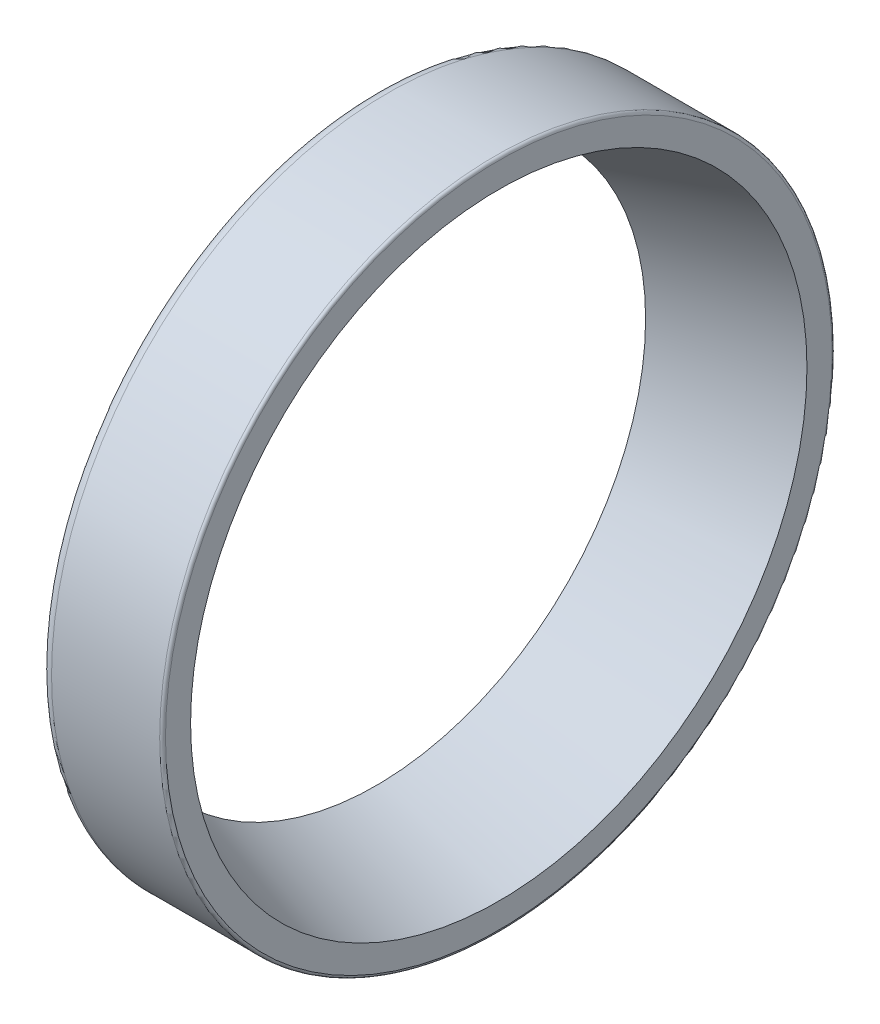
ISO-10303-21;
HEADER;
FILE_DESCRIPTION(('STEP AP214'),'2;1');
FILE_NAME('part.step','',(''),(''),'','','');
FILE_SCHEMA(('AUTOMOTIVE_DESIGN { 1 0 10303 214 1 1 1 1 }'));
ENDSEC;
DATA;
#1=APPLICATION_CONTEXT('core data for automotive mechanical design processes');
#2=APPLICATION_PROTOCOL_DEFINITION('international standard','automotive_design',2000,#1);
#3=PRODUCT_CONTEXT('',#1,'mechanical');
#4=PRODUCT('Part','Part','',(#3));
#5=PRODUCT_RELATED_PRODUCT_CATEGORY('part','',(#4));
#6=PRODUCT_DEFINITION_FORMATION('','',#4);
#7=PRODUCT_DEFINITION_CONTEXT('part definition',#1,'design');
#8=PRODUCT_DEFINITION('design','',#6,#7);
#9=PRODUCT_DEFINITION_SHAPE('','',#8);
#10=(LENGTH_UNIT() NAMED_UNIT(*) SI_UNIT(.MILLI.,.METRE.));
#11=(NAMED_UNIT(*) PLANE_ANGLE_UNIT() SI_UNIT($,.RADIAN.));
#12=(NAMED_UNIT(*) SI_UNIT($,.STERADIAN.) SOLID_ANGLE_UNIT());
#13=UNCERTAINTY_MEASURE_WITH_UNIT(LENGTH_MEASURE(1.E-05),#10,'distance_accuracy_value','');
#14=(GEOMETRIC_REPRESENTATION_CONTEXT(3) GLOBAL_UNCERTAINTY_ASSIGNED_CONTEXT((#13)) GLOBAL_UNIT_ASSIGNED_CONTEXT((#10,
#11,#12)) REPRESENTATION_CONTEXT('',''));
#15=CARTESIAN_POINT('',(0.,0.,0.));
#16=DIRECTION('',(0.,0.,1.));
#17=DIRECTION('',(1.,0.,0.));
#18=AXIS2_PLACEMENT_3D('',#15,#16,#17);
#19=CARTESIAN_POINT('',(6.13537,0.,0.));
#20=DIRECTION('',(-1.,0.,0.));
#21=DIRECTION('',(0.,0.,1.));
#22=AXIS2_PLACEMENT_3D('',#19,#20,#21);
#23=CYLINDRICAL_SURFACE('',#22,29.36875);
#24=CARTESIAN_POINT('',(10.8585,0.,0.));
#25=DIRECTION('',(1.,0.,0.));
#26=DIRECTION('',(0.,0.,-1.));
#27=AXIS2_PLACEMENT_3D('',#24,#25,#26);
#28=CIRCLE('',#27,29.36875);
#29=CARTESIAN_POINT('',(10.8585,0.,-29.36875));
#30=VERTEX_POINT('',#29);
#31=EDGE_CURVE('E31',#30,#30,#28,.T.);
#32=ORIENTED_EDGE('',*,*,#31,.F.);
#33=EDGE_LOOP('',(#32));
#34=FACE_BOUND('',#33,.T.);
#35=CARTESIAN_POINT('',(1.41224000000001,0.,0.));
#36=DIRECTION('',(-1.,0.,0.));
#37=DIRECTION('',(0.,-1.,0.));
#38=AXIS2_PLACEMENT_3D('',#35,#36,#37);
#39=CIRCLE('',#38,29.36875);
#40=CARTESIAN_POINT('',(1.41224000000001,-29.36875,0.));
#41=VERTEX_POINT('',#40);
#42=EDGE_CURVE('E37',#41,#41,#39,.T.);
#43=ORIENTED_EDGE('',*,*,#42,.F.);
#44=EDGE_LOOP('',(#43));
#45=FACE_BOUND('',#44,.T.);
#46=ADVANCED_FACE('F15',(#34,#45),#23,.T.);
#47=CARTESIAN_POINT('',(10.8585,0.,0.));
#48=DIRECTION('',(-1.,0.,0.));
#49=DIRECTION('',(0.,0.,1.));
#50=AXIS2_PLACEMENT_3D('',#47,#48,#49);
#51=TOROIDAL_SURFACE('',#50,29.11475,0.254000000000001);
#52=ORIENTED_EDGE('',*,*,#31,.T.);
#53=EDGE_LOOP('',(#52));
#54=FACE_BOUND('',#53,.T.);
#55=CARTESIAN_POINT('',(11.1125,0.,0.));
#56=DIRECTION('',(-1.,0.,0.));
#57=DIRECTION('',(0.,0.,1.));
#58=AXIS2_PLACEMENT_3D('',#55,#56,#57);
#59=CIRCLE('',#58,29.11475);
#60=CARTESIAN_POINT('',(11.1125,0.,29.11475));
#61=VERTEX_POINT('',#60);
#62=EDGE_CURVE('E19',#61,#61,#59,.F.);
#63=ORIENTED_EDGE('',*,*,#62,.F.);
#64=EDGE_LOOP('',(#63));
#65=FACE_BOUND('',#64,.T.);
#66=ADVANCED_FACE('F46',(#54,#65),#51,.T.);
#67=CARTESIAN_POINT('',(1.41224,0.,0.));
#68=DIRECTION('',(-1.,0.,0.));
#69=DIRECTION('',(0.,0.,1.));
#70=AXIS2_PLACEMENT_3D('',#67,#68,#69);
#71=TOROIDAL_SURFACE('',#70,28.35275,1.016);
#72=ORIENTED_EDGE('',*,*,#42,.T.);
#73=EDGE_LOOP('',(#72));
#74=FACE_BOUND('',#73,.T.);
#75=CARTESIAN_POINT('',(0.39624,0.,0.));
#76=DIRECTION('',(-1.,0.,0.));
#77=DIRECTION('',(0.,0.,1.));
#78=AXIS2_PLACEMENT_3D('',#75,#76,#77);
#79=CIRCLE('',#78,28.35275);
#80=CARTESIAN_POINT('',(0.39624,0.,28.35275));
#81=VERTEX_POINT('',#80);
#82=EDGE_CURVE('E28',#81,#81,#79,.T.);
#83=ORIENTED_EDGE('',*,*,#82,.F.);
#84=EDGE_LOOP('',(#83));
#85=FACE_BOUND('',#84,.T.);
#86=ADVANCED_FACE('F17',(#74,#85),#71,.T.);
#87=CARTESIAN_POINT('',(11.1125,0.,28.0183508323314));
#88=DIRECTION('',(1.,0.,0.));
#89=DIRECTION('',(0.,0.,-1.));
#90=AXIS2_PLACEMENT_3D('',#87,#88,#89);
#91=PLANE('',#90);
#92=ORIENTED_EDGE('',*,*,#62,.T.);
#93=EDGE_LOOP('',(#92));
#94=FACE_BOUND('',#93,.T.);
#95=CARTESIAN_POINT('',(11.1125,0.,0.));
#96=DIRECTION('',(1.,0.,0.));
#97=DIRECTION('',(0.,0.,-1.));
#98=AXIS2_PLACEMENT_3D('',#95,#96,#97);
#99=CIRCLE('',#98,26.9219516646627);
#100=CARTESIAN_POINT('',(11.1125,0.,-26.9219516646627));
#101=VERTEX_POINT('',#100);
#102=EDGE_CURVE('E23',#101,#101,#99,.F.);
#103=ORIENTED_EDGE('',*,*,#102,.T.);
#104=EDGE_LOOP('',(#103));
#105=FACE_BOUND('',#104,.T.);
#106=ADVANCED_FACE('F65',(#94,#105),#91,.T.);
#107=CARTESIAN_POINT('',(0.396240000000003,0.,25.9479552122571));
#108=DIRECTION('',(-1.,0.,0.));
#109=DIRECTION('',(0.,0.,1.));
#110=AXIS2_PLACEMENT_3D('',#107,#108,#109);
#111=PLANE('',#110);
#112=CARTESIAN_POINT('',(0.396240000000006,0.,0.));
#113=DIRECTION('',(1.,0.,0.));
#114=DIRECTION('',(0.,0.,-1.));
#115=AXIS2_PLACEMENT_3D('',#112,#113,#114);
#116=CIRCLE('',#115,23.5431604245143);
#117=CARTESIAN_POINT('',(0.396240000000006,0.,-23.5431604245143));
#118=VERTEX_POINT('',#117);
#119=EDGE_CURVE('E10',#118,#118,#116,.T.);
#120=ORIENTED_EDGE('',*,*,#119,.T.);
#121=EDGE_LOOP('',(#120));
#122=FACE_BOUND('',#121,.T.);
#123=ORIENTED_EDGE('',*,*,#82,.T.);
#124=EDGE_LOOP('',(#123));
#125=FACE_BOUND('',#124,.T.);
#126=ADVANCED_FACE('F59',(#122,#125),#111,.T.);
#127=CARTESIAN_POINT('',(11.1125,0.,0.));
#128=DIRECTION('',(1.,0.,0.));
#129=DIRECTION('',(0.,0.,-1.));
#130=AXIS2_PLACEMENT_3D('',#127,#128,#129);
#131=CONICAL_SURFACE('',#130,26.9219516646627,0.305429855535925);
#132=ORIENTED_EDGE('',*,*,#102,.F.);
#133=EDGE_LOOP('',(#132));
#134=FACE_BOUND('',#133,.T.);
#135=ORIENTED_EDGE('',*,*,#119,.F.);
#136=EDGE_LOOP('',(#135));
#137=FACE_BOUND('',#136,.T.);
#138=ADVANCED_FACE('F57',(#134,#137),#131,.F.);
#139=CLOSED_SHELL('',(#46,#66,#86,#106,#126,#138));
#140=MANIFOLD_SOLID_BREP('B1',#139);
#141=ADVANCED_BREP_SHAPE_REPRESENTATION('',(#18,#140),#14);
#142=SHAPE_DEFINITION_REPRESENTATION(#9,#141);
ENDSEC;
END-ISO-10303-21;
